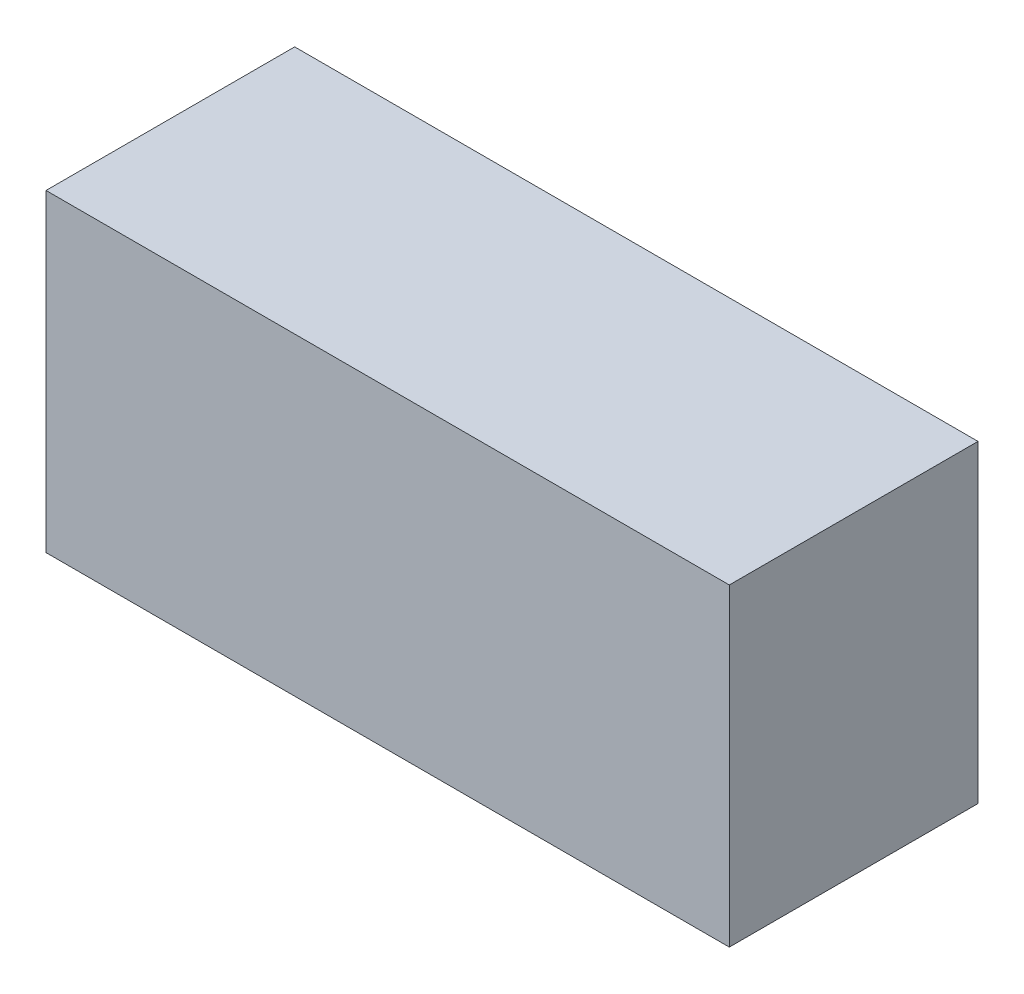
ISO-10303-21;
HEADER;
FILE_DESCRIPTION(('STEP AP214'),'2;1');
FILE_NAME('part.step','',(''),(''),'','','');
FILE_SCHEMA(('AUTOMOTIVE_DESIGN { 1 0 10303 214 1 1 1 1 }'));
ENDSEC;
DATA;
#1=APPLICATION_CONTEXT('core data for automotive mechanical design processes');
#2=APPLICATION_PROTOCOL_DEFINITION('international standard','automotive_design',2000,#1);
#3=PRODUCT_CONTEXT('',#1,'mechanical');
#4=PRODUCT('Part','Part','',(#3));
#5=PRODUCT_RELATED_PRODUCT_CATEGORY('part','',(#4));
#6=PRODUCT_DEFINITION_FORMATION('','',#4);
#7=PRODUCT_DEFINITION_CONTEXT('part definition',#1,'design');
#8=PRODUCT_DEFINITION('design','',#6,#7);
#9=PRODUCT_DEFINITION_SHAPE('','',#8);
#10=(LENGTH_UNIT() NAMED_UNIT(*) SI_UNIT(.MILLI.,.METRE.));
#11=(NAMED_UNIT(*) PLANE_ANGLE_UNIT() SI_UNIT($,.RADIAN.));
#12=(NAMED_UNIT(*) SI_UNIT($,.STERADIAN.) SOLID_ANGLE_UNIT());
#13=UNCERTAINTY_MEASURE_WITH_UNIT(LENGTH_MEASURE(1.E-05),#10,'distance_accuracy_value','');
#14=(GEOMETRIC_REPRESENTATION_CONTEXT(3) GLOBAL_UNCERTAINTY_ASSIGNED_CONTEXT((#13)) GLOBAL_UNIT_ASSIGNED_CONTEXT((#10,
#11,#12)) REPRESENTATION_CONTEXT('',''));
#15=CARTESIAN_POINT('',(0.,0.,0.));
#16=DIRECTION('',(0.,0.,1.));
#17=DIRECTION('',(1.,0.,0.));
#18=AXIS2_PLACEMENT_3D('',#15,#16,#17);
#19=CARTESIAN_POINT('',(-1.52499822,-0.6999986,1.11000032));
#20=DIRECTION('',(0.,0.,-1.));
#21=DIRECTION('',(-1.,0.,0.));
#22=AXIS2_PLACEMENT_3D('',#19,#20,#21);
#23=PLANE('',#22);
#24=DIRECTION('',(0.,1.,0.));
#25=VECTOR('',#24,1.);
#26=CARTESIAN_POINT('',(1.52500076,-0.6999986,1.11000032));
#27=LINE('',#26,#25);
#28=CARTESIAN_POINT('',(1.52500076,-0.6999986,1.11000032));
#29=VERTEX_POINT('',#28);
#30=CARTESIAN_POINT('',(1.52500076,0.70000114,1.11000032));
#31=VERTEX_POINT('',#30);
#32=EDGE_CURVE('E54',#29,#31,#27,.T.);
#33=ORIENTED_EDGE('',*,*,#32,.T.);
#34=DIRECTION('',(1.,0.,0.));
#35=VECTOR('',#34,1.);
#36=CARTESIAN_POINT('',(1.52500076,0.70000114,1.11000032));
#37=LINE('',#36,#35);
#38=CARTESIAN_POINT('',(-1.52499822,0.70000114,1.11000032));
#39=VERTEX_POINT('',#38);
#40=EDGE_CURVE('E56',#31,#39,#37,.F.);
#41=ORIENTED_EDGE('',*,*,#40,.T.);
#42=DIRECTION('',(0.,1.,0.));
#43=VECTOR('',#42,1.);
#44=CARTESIAN_POINT('',(-1.52499822,0.70000114,1.11000032));
#45=LINE('',#44,#43);
#46=CARTESIAN_POINT('',(-1.52499822,-0.6999986,1.11000032));
#47=VERTEX_POINT('',#46);
#48=EDGE_CURVE('E19',#39,#47,#45,.F.);
#49=ORIENTED_EDGE('',*,*,#48,.T.);
#50=DIRECTION('',(1.,0.,0.));
#51=VECTOR('',#50,1.);
#52=CARTESIAN_POINT('',(-1.52499822,-0.6999986,1.11000032));
#53=LINE('',#52,#51);
#54=EDGE_CURVE('E79',#47,#29,#53,.T.);
#55=ORIENTED_EDGE('',*,*,#54,.T.);
#56=EDGE_LOOP('',(#33,#41,#49,#55));
#57=FACE_BOUND('',#56,.T.);
#58=ADVANCED_FACE('F16',(#57),#23,.F.);
#59=CARTESIAN_POINT('',(-1.52499822,0.70000114,0.));
#60=DIRECTION('',(1.,0.,0.));
#61=DIRECTION('',(0.,0.,-1.));
#62=AXIS2_PLACEMENT_3D('',#59,#60,#61);
#63=PLANE('',#62);
#64=DIRECTION('',(0.,0.,1.));
#65=VECTOR('',#64,1.);
#66=CARTESIAN_POINT('',(-1.52499822,-0.6999986,0.));
#67=LINE('',#66,#65);
#68=CARTESIAN_POINT('',(-1.52499822,-0.6999986,0.));
#69=VERTEX_POINT('',#68);
#70=EDGE_CURVE('E67',#69,#47,#67,.T.);
#71=ORIENTED_EDGE('',*,*,#70,.T.);
#72=ORIENTED_EDGE('',*,*,#48,.F.);
#73=DIRECTION('',(0.,0.,-1.));
#74=VECTOR('',#73,1.);
#75=CARTESIAN_POINT('',(-1.52499822,0.70000114,0.));
#76=LINE('',#75,#74);
#77=CARTESIAN_POINT('',(-1.52499822,0.70000114,0.));
#78=VERTEX_POINT('',#77);
#79=EDGE_CURVE('E62',#39,#78,#76,.T.);
#80=ORIENTED_EDGE('',*,*,#79,.T.);
#81=DIRECTION('',(0.,1.,0.));
#82=VECTOR('',#81,1.);
#83=CARTESIAN_POINT('',(-1.52499822,-0.6999986,0.));
#84=LINE('',#83,#82);
#85=EDGE_CURVE('E82',#69,#78,#84,.T.);
#86=ORIENTED_EDGE('',*,*,#85,.F.);
#87=EDGE_LOOP('',(#71,#72,#80,#86));
#88=FACE_BOUND('',#87,.T.);
#89=ADVANCED_FACE('F64',(#88),#63,.F.);
#90=CARTESIAN_POINT('',(1.52500076,0.70000114,0.));
#91=DIRECTION('',(0.,-1.,0.));
#92=DIRECTION('',(0.,0.,-1.));
#93=AXIS2_PLACEMENT_3D('',#90,#91,#92);
#94=PLANE('',#93);
#95=ORIENTED_EDGE('',*,*,#79,.F.);
#96=ORIENTED_EDGE('',*,*,#40,.F.);
#97=DIRECTION('',(0.,0.,1.));
#98=VECTOR('',#97,1.);
#99=CARTESIAN_POINT('',(1.52500076,0.70000114,0.));
#100=LINE('',#99,#98);
#101=CARTESIAN_POINT('',(1.52500076,0.70000114,0.));
#102=VERTEX_POINT('',#101);
#103=EDGE_CURVE('E74',#31,#102,#100,.F.);
#104=ORIENTED_EDGE('',*,*,#103,.T.);
#105=DIRECTION('',(-1.,0.,0.));
#106=VECTOR('',#105,1.);
#107=CARTESIAN_POINT('',(-1.52499822,0.70000114,0.));
#108=LINE('',#107,#106);
#109=EDGE_CURVE('E71',#78,#102,#108,.F.);
#110=ORIENTED_EDGE('',*,*,#109,.F.);
#111=EDGE_LOOP('',(#95,#96,#104,#110));
#112=FACE_BOUND('',#111,.T.);
#113=ADVANCED_FACE('F69',(#112),#94,.F.);
#114=CARTESIAN_POINT('',(1.52500076,-0.6999986,0.));
#115=DIRECTION('',(-1.,0.,0.));
#116=DIRECTION('',(0.,0.,1.));
#117=AXIS2_PLACEMENT_3D('',#114,#115,#116);
#118=PLANE('',#117);
#119=ORIENTED_EDGE('',*,*,#103,.F.);
#120=ORIENTED_EDGE('',*,*,#32,.F.);
#121=DIRECTION('',(0.,0.,1.));
#122=VECTOR('',#121,1.);
#123=CARTESIAN_POINT('',(1.52500076,-0.6999986,0.));
#124=LINE('',#123,#122);
#125=CARTESIAN_POINT('',(1.52500076,-0.6999986,0.));
#126=VERTEX_POINT('',#125);
#127=EDGE_CURVE('E34',#29,#126,#124,.F.);
#128=ORIENTED_EDGE('',*,*,#127,.T.);
#129=DIRECTION('',(0.,1.,0.));
#130=VECTOR('',#129,1.);
#131=CARTESIAN_POINT('',(1.52500076,-0.6999986,0.));
#132=LINE('',#131,#130);
#133=EDGE_CURVE('E25',#102,#126,#132,.F.);
#134=ORIENTED_EDGE('',*,*,#133,.F.);
#135=EDGE_LOOP('',(#119,#120,#128,#134));
#136=FACE_BOUND('',#135,.T.);
#137=ADVANCED_FACE('F88',(#136),#118,.F.);
#138=CARTESIAN_POINT('',(-1.52499822,-0.6999986,0.));
#139=DIRECTION('',(0.,1.,0.));
#140=DIRECTION('',(0.,0.,1.));
#141=AXIS2_PLACEMENT_3D('',#138,#139,#140);
#142=PLANE('',#141);
#143=ORIENTED_EDGE('',*,*,#127,.F.);
#144=ORIENTED_EDGE('',*,*,#54,.F.);
#145=ORIENTED_EDGE('',*,*,#70,.F.);
#146=DIRECTION('',(-1.,0.,0.));
#147=VECTOR('',#146,1.);
#148=CARTESIAN_POINT('',(-1.52499822,-0.6999986,0.));
#149=LINE('',#148,#147);
#150=EDGE_CURVE('E10',#126,#69,#149,.T.);
#151=ORIENTED_EDGE('',*,*,#150,.F.);
#152=EDGE_LOOP('',(#143,#144,#145,#151));
#153=FACE_BOUND('',#152,.T.);
#154=ADVANCED_FACE('F90',(#153),#142,.F.);
#155=CARTESIAN_POINT('',(-1.52499822,-0.6999986,0.));
#156=DIRECTION('',(0.,0.,-1.));
#157=DIRECTION('',(-1.,0.,0.));
#158=AXIS2_PLACEMENT_3D('',#155,#156,#157);
#159=PLANE('',#158);
#160=ORIENTED_EDGE('',*,*,#133,.T.);
#161=ORIENTED_EDGE('',*,*,#150,.T.);
#162=ORIENTED_EDGE('',*,*,#85,.T.);
#163=ORIENTED_EDGE('',*,*,#109,.T.);
#164=EDGE_LOOP('',(#160,#161,#162,#163));
#165=FACE_BOUND('',#164,.T.);
#166=ADVANCED_FACE('F87',(#165),#159,.T.);
#167=CLOSED_SHELL('',(#58,#89,#113,#137,#154,#166));
#168=MANIFOLD_SOLID_BREP('B1',#167);
#169=ADVANCED_BREP_SHAPE_REPRESENTATION('',(#18,#168),#14);
#170=SHAPE_DEFINITION_REPRESENTATION(#9,#169);
ENDSEC;
END-ISO-10303-21;
